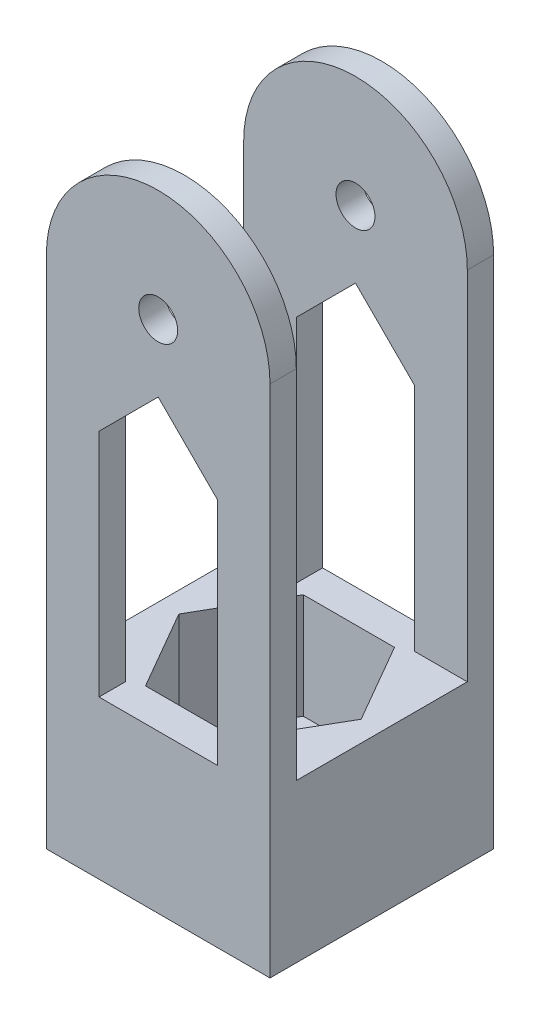
ISO-10303-21;
HEADER;
FILE_DESCRIPTION(('STEP AP214'),'2;1');
FILE_NAME('part.step','',(''),(''),'','','');
FILE_SCHEMA(('AUTOMOTIVE_DESIGN { 1 0 10303 214 1 1 1 1 }'));
ENDSEC;
DATA;
#1=APPLICATION_CONTEXT('core data for automotive mechanical design processes');
#2=APPLICATION_PROTOCOL_DEFINITION('international standard','automotive_design',2000,#1);
#3=PRODUCT_CONTEXT('',#1,'mechanical');
#4=PRODUCT('Part','Part','',(#3));
#5=PRODUCT_RELATED_PRODUCT_CATEGORY('part','',(#4));
#6=PRODUCT_DEFINITION_FORMATION('','',#4);
#7=PRODUCT_DEFINITION_CONTEXT('part definition',#1,'design');
#8=PRODUCT_DEFINITION('design','',#6,#7);
#9=PRODUCT_DEFINITION_SHAPE('','',#8);
#10=(LENGTH_UNIT() NAMED_UNIT(*) SI_UNIT(.MILLI.,.METRE.));
#11=(NAMED_UNIT(*) PLANE_ANGLE_UNIT() SI_UNIT($,.RADIAN.));
#12=(NAMED_UNIT(*) SI_UNIT($,.STERADIAN.) SOLID_ANGLE_UNIT());
#13=UNCERTAINTY_MEASURE_WITH_UNIT(LENGTH_MEASURE(1.E-05),#10,'distance_accuracy_value','');
#14=(GEOMETRIC_REPRESENTATION_CONTEXT(3) GLOBAL_UNCERTAINTY_ASSIGNED_CONTEXT((#13)) GLOBAL_UNIT_ASSIGNED_CONTEXT((#10,
#11,#12)) REPRESENTATION_CONTEXT('',''));
#15=CARTESIAN_POINT('',(0.,0.,0.));
#16=DIRECTION('',(0.,0.,1.));
#17=DIRECTION('',(1.,0.,0.));
#18=AXIS2_PLACEMENT_3D('',#15,#16,#17);
#19=CARTESIAN_POINT('',(0.,19.05,0.));
#20=DIRECTION('',(0.,1.,0.));
#21=DIRECTION('',(0.,0.,1.));
#22=AXIS2_PLACEMENT_3D('',#19,#20,#21);
#23=PLANE('',#22);
#24=DIRECTION('',(-0.5,0.,-0.866025403784439));
#25=VECTOR('',#24,1.);
#26=CARTESIAN_POINT('',(24.4922726280624,19.05,-13.49375));
#27=LINE('',#26,#25);
#28=CARTESIAN_POINT('',(24.4922726280624,19.05,-13.49375));
#29=VERTEX_POINT('',#28);
#30=CARTESIAN_POINT('',(18.9930113140312,19.05,-23.01875));
#31=VERTEX_POINT('',#30);
#32=EDGE_CURVE('E439',#29,#31,#27,.T.);
#33=ORIENTED_EDGE('',*,*,#32,.F.);
#34=DIRECTION('',(0.5,0.,-0.866025403784439));
#35=VECTOR('',#34,1.);
#36=CARTESIAN_POINT('',(18.9930113140312,19.05,-3.96874999999999));
#37=LINE('',#36,#35);
#38=CARTESIAN_POINT('',(18.9930113140312,19.05,-3.96874999999999));
#39=VERTEX_POINT('',#38);
#40=EDGE_CURVE('E461',#39,#29,#37,.T.);
#41=ORIENTED_EDGE('',*,*,#40,.F.);
#42=DIRECTION('',(1.,0.,0.));
#43=VECTOR('',#42,1.);
#44=CARTESIAN_POINT('',(7.99448868596881,19.05,-3.96875));
#45=LINE('',#44,#43);
#46=CARTESIAN_POINT('',(7.99448868596881,19.05,-3.96875));
#47=VERTEX_POINT('',#46);
#48=EDGE_CURVE('E458',#47,#39,#45,.T.);
#49=ORIENTED_EDGE('',*,*,#48,.F.);
#50=DIRECTION('',(0.5,0.,0.866025403784439));
#51=VECTOR('',#50,1.);
#52=CARTESIAN_POINT('',(2.49522737193762,19.05,-13.49375));
#53=LINE('',#52,#51);
#54=CARTESIAN_POINT('',(2.49522737193762,19.05,-13.49375));
#55=VERTEX_POINT('',#54);
#56=EDGE_CURVE('E456',#55,#47,#53,.T.);
#57=ORIENTED_EDGE('',*,*,#56,.F.);
#58=DIRECTION('',(-0.5,0.,0.866025403784439));
#59=VECTOR('',#58,1.);
#60=CARTESIAN_POINT('',(7.9944886859688,19.05,-23.01875));
#61=LINE('',#60,#59);
#62=CARTESIAN_POINT('',(7.99448868596881,19.05,-23.01875));
#63=VERTEX_POINT('',#62);
#64=EDGE_CURVE('E431',#63,#55,#61,.T.);
#65=ORIENTED_EDGE('',*,*,#64,.F.);
#66=DIRECTION('',(-1.,0.,0.));
#67=VECTOR('',#66,1.);
#68=CARTESIAN_POINT('',(18.9930113140312,19.05,-23.01875));
#69=LINE('',#68,#67);
#70=EDGE_CURVE('E430',#31,#63,#69,.T.);
#71=ORIENTED_EDGE('',*,*,#70,.F.);
#72=EDGE_LOOP('',(#33,#41,#49,#57,#65,#71));
#73=FACE_BOUND('',#72,.T.);
#74=DIRECTION('',(0.,0.,-1.));
#75=VECTOR('',#74,1.);
#76=CARTESIAN_POINT('',(20.6375,19.05,0.));
#77=LINE('',#76,#75);
#78=CARTESIAN_POINT('',(20.6375,19.05,0.));
#79=VERTEX_POINT('',#78);
#80=CARTESIAN_POINT('',(20.6375,19.05,-3.175));
#81=VERTEX_POINT('',#80);
#82=EDGE_CURVE('E200',#79,#81,#77,.T.);
#83=ORIENTED_EDGE('',*,*,#82,.T.);
#84=DIRECTION('',(-1.,0.,0.));
#85=VECTOR('',#84,1.);
#86=CARTESIAN_POINT('',(0.,19.05,-3.175));
#87=LINE('',#86,#85);
#88=CARTESIAN_POINT('',(26.9875,19.05,-3.175));
#89=VERTEX_POINT('',#88);
#90=EDGE_CURVE('E277',#89,#81,#87,.T.);
#91=ORIENTED_EDGE('',*,*,#90,.F.);
#92=DIRECTION('',(0.,0.,-1.));
#93=VECTOR('',#92,1.);
#94=CARTESIAN_POINT('',(26.9875,19.05,0.));
#95=LINE('',#94,#93);
#96=CARTESIAN_POINT('',(26.9875,19.05,-23.8125));
#97=VERTEX_POINT('',#96);
#98=EDGE_CURVE('E327',#89,#97,#95,.T.);
#99=ORIENTED_EDGE('',*,*,#98,.T.);
#100=DIRECTION('',(-1.,0.,0.));
#101=VECTOR('',#100,1.);
#102=CARTESIAN_POINT('',(0.,19.05,-23.8125));
#103=LINE('',#102,#101);
#104=CARTESIAN_POINT('',(20.6375,19.05,-23.8125));
#105=VERTEX_POINT('',#104);
#106=EDGE_CURVE('E307',#97,#105,#103,.T.);
#107=ORIENTED_EDGE('',*,*,#106,.T.);
#108=CARTESIAN_POINT('',(20.6375,19.05,-26.9875));
#109=VERTEX_POINT('',#108);
#110=EDGE_CURVE('E211',#105,#109,#77,.T.);
#111=ORIENTED_EDGE('',*,*,#110,.T.);
#112=DIRECTION('',(-1.,0.,0.));
#113=VECTOR('',#112,1.);
#114=CARTESIAN_POINT('',(20.6375,19.05,-26.9875));
#115=LINE('',#114,#113);
#116=CARTESIAN_POINT('',(6.34999999999999,19.05,-26.9875));
#117=VERTEX_POINT('',#116);
#118=EDGE_CURVE('E234',#109,#117,#115,.T.);
#119=ORIENTED_EDGE('',*,*,#118,.T.);
#120=DIRECTION('',(0.,0.,-1.));
#121=VECTOR('',#120,1.);
#122=CARTESIAN_POINT('',(6.34999999999999,19.05,0.));
#123=LINE('',#122,#121);
#124=CARTESIAN_POINT('',(6.34999999999999,19.05,-23.8125));
#125=VERTEX_POINT('',#124);
#126=EDGE_CURVE('E210',#125,#117,#123,.T.);
#127=ORIENTED_EDGE('',*,*,#126,.F.);
#128=CARTESIAN_POINT('',(0.,19.05,-23.8125));
#129=VERTEX_POINT('',#128);
#130=EDGE_CURVE('E41',#125,#129,#103,.T.);
#131=ORIENTED_EDGE('',*,*,#130,.T.);
#132=DIRECTION('',(0.,0.,-1.));
#133=VECTOR('',#132,1.);
#134=CARTESIAN_POINT('',(0.,19.05,0.));
#135=LINE('',#134,#133);
#136=CARTESIAN_POINT('',(0.,19.05,-3.175));
#137=VERTEX_POINT('',#136);
#138=EDGE_CURVE('E322',#137,#129,#135,.T.);
#139=ORIENTED_EDGE('',*,*,#138,.F.);
#140=CARTESIAN_POINT('',(6.34999999999999,19.05,-3.175));
#141=VERTEX_POINT('',#140);
#142=EDGE_CURVE('E276',#141,#137,#87,.T.);
#143=ORIENTED_EDGE('',*,*,#142,.F.);
#144=CARTESIAN_POINT('',(6.34999999999999,19.05,0.));
#145=VERTEX_POINT('',#144);
#146=EDGE_CURVE('E216',#145,#141,#123,.T.);
#147=ORIENTED_EDGE('',*,*,#146,.F.);
#148=DIRECTION('',(-1.,0.,0.));
#149=VECTOR('',#148,1.);
#150=CARTESIAN_POINT('',(20.6375,19.05,0.));
#151=LINE('',#150,#149);
#152=EDGE_CURVE('E214',#79,#145,#151,.T.);
#153=ORIENTED_EDGE('',*,*,#152,.F.);
#154=EDGE_LOOP('',(#83,#91,#99,#107,#111,#119,#127,#131,#139,#143,#147,#153));
#155=FACE_BOUND('',#154,.T.);
#156=ADVANCED_FACE('F37',(#73,#155),#23,.T.);
#157=CARTESIAN_POINT('',(13.49375,0.,-13.49375));
#158=DIRECTION('',(0.,1.,0.));
#159=DIRECTION('',(0.,0.,1.));
#160=AXIS2_PLACEMENT_3D('',#157,#158,#159);
#161=CYLINDRICAL_SURFACE('',#160,6.985);
#162=CARTESIAN_POINT('',(13.49375,0.,-13.49375));
#163=DIRECTION('',(0.,1.,0.));
#164=DIRECTION('',(0.,0.,1.));
#165=AXIS2_PLACEMENT_3D('',#162,#163,#164);
#166=CIRCLE('',#165,6.985);
#167=CARTESIAN_POINT('',(13.49375,0.,-6.50875));
#168=VERTEX_POINT('',#167);
#169=EDGE_CURVE('E338',#168,#168,#166,.T.);
#170=ORIENTED_EDGE('',*,*,#169,.F.);
#171=EDGE_LOOP('',(#170));
#172=FACE_BOUND('',#171,.T.);
#173=CARTESIAN_POINT('',(13.49375,6.35,-13.49375));
#174=DIRECTION('',(0.,1.,0.));
#175=DIRECTION('',(0.,0.,1.));
#176=AXIS2_PLACEMENT_3D('',#173,#174,#175);
#177=CIRCLE('',#176,6.985);
#178=CARTESIAN_POINT('',(13.49375,6.35,-6.50875));
#179=VERTEX_POINT('',#178);
#180=EDGE_CURVE('E312',#179,#179,#177,.F.);
#181=ORIENTED_EDGE('',*,*,#180,.F.);
#182=EDGE_LOOP('',(#181));
#183=FACE_BOUND('',#182,.T.);
#184=ADVANCED_FACE('F387',(#172,#183),#161,.F.);
#185=CARTESIAN_POINT('',(0.,19.05,0.));
#186=DIRECTION('',(0.,0.,-1.));
#187=DIRECTION('',(-1.,0.,0.));
#188=AXIS2_PLACEMENT_3D('',#185,#186,#187);
#189=PLANE('',#188);
#190=DIRECTION('',(0.707106781186549,-0.707106781186546,0.));
#191=VECTOR('',#190,1.);
#192=CARTESIAN_POINT('',(20.6375,46.83125,0.));
#193=LINE('',#192,#191);
#194=CARTESIAN_POINT('',(13.49375,53.975,0.));
#195=VERTEX_POINT('',#194);
#196=CARTESIAN_POINT('',(20.6375,46.83125,0.));
#197=VERTEX_POINT('',#196);
#198=EDGE_CURVE('E222',#195,#197,#193,.T.);
#199=ORIENTED_EDGE('',*,*,#198,.T.);
#200=DIRECTION('',(0.,-1.,0.));
#201=VECTOR('',#200,1.);
#202=CARTESIAN_POINT('',(20.6375,19.05,0.));
#203=LINE('',#202,#201);
#204=EDGE_CURVE('E205',#197,#79,#203,.T.);
#205=ORIENTED_EDGE('',*,*,#204,.T.);
#206=ORIENTED_EDGE('',*,*,#152,.T.);
#207=DIRECTION('',(0.,1.,0.));
#208=VECTOR('',#207,1.);
#209=CARTESIAN_POINT('',(6.34999999999999,19.05,0.));
#210=LINE('',#209,#208);
#211=CARTESIAN_POINT('',(6.34999999999999,46.83125,0.));
#212=VERTEX_POINT('',#211);
#213=EDGE_CURVE('E54',#145,#212,#210,.T.);
#214=ORIENTED_EDGE('',*,*,#213,.T.);
#215=DIRECTION('',(0.707106781186546,0.707106781186549,0.));
#216=VECTOR('',#215,1.);
#217=CARTESIAN_POINT('',(13.49375,53.975,0.));
#218=LINE('',#217,#216);
#219=EDGE_CURVE('E230',#212,#195,#218,.T.);
#220=ORIENTED_EDGE('',*,*,#219,.T.);
#221=EDGE_LOOP('',(#199,#205,#206,#214,#220));
#222=FACE_BOUND('',#221,.T.);
#223=DIRECTION('',(1.,0.,0.));
#224=VECTOR('',#223,1.);
#225=CARTESIAN_POINT('',(0.,0.,0.));
#226=LINE('',#225,#224);
#227=CARTESIAN_POINT('',(0.,0.,0.));
#228=VERTEX_POINT('',#227);
#229=CARTESIAN_POINT('',(26.9875,0.,0.));
#230=VERTEX_POINT('',#229);
#231=EDGE_CURVE('E334',#228,#230,#226,.T.);
#232=ORIENTED_EDGE('',*,*,#231,.T.);
#233=DIRECTION('',(0.,-1.,0.));
#234=VECTOR('',#233,1.);
#235=CARTESIAN_POINT('',(26.9875,19.05,0.));
#236=LINE('',#235,#234);
#237=CARTESIAN_POINT('',(26.9875,62.0875,0.));
#238=VERTEX_POINT('',#237);
#239=EDGE_CURVE('E351',#238,#230,#236,.T.);
#240=ORIENTED_EDGE('',*,*,#239,.F.);
#241=CARTESIAN_POINT('',(13.49375,62.0875,0.));
#242=DIRECTION('',(0.,0.,-1.));
#243=DIRECTION('',(-1.,0.,0.));
#244=AXIS2_PLACEMENT_3D('',#241,#242,#243);
#245=CIRCLE('',#244,13.49375);
#246=CARTESIAN_POINT('',(0.,62.0875,0.));
#247=VERTEX_POINT('',#246);
#248=EDGE_CURVE('E270',#247,#238,#245,.T.);
#249=ORIENTED_EDGE('',*,*,#248,.F.);
#250=DIRECTION('',(0.,-1.,0.));
#251=VECTOR('',#250,1.);
#252=CARTESIAN_POINT('',(0.,19.05,0.));
#253=LINE('',#252,#251);
#254=EDGE_CURVE('E326',#247,#228,#253,.T.);
#255=ORIENTED_EDGE('',*,*,#254,.T.);
#256=EDGE_LOOP('',(#232,#240,#249,#255));
#257=FACE_BOUND('',#256,.T.);
#258=CARTESIAN_POINT('',(13.49375,62.0875,0.));
#259=DIRECTION('',(0.,0.,-1.));
#260=DIRECTION('',(-1.,0.,0.));
#261=AXIS2_PLACEMENT_3D('',#258,#259,#260);
#262=CIRCLE('',#261,2.3495);
#263=CARTESIAN_POINT('',(11.14425,62.0875,0.));
#264=VERTEX_POINT('',#263);
#265=EDGE_CURVE('E266',#264,#264,#262,.T.);
#266=ORIENTED_EDGE('',*,*,#265,.T.);
#267=EDGE_LOOP('',(#266));
#268=FACE_BOUND('',#267,.T.);
#269=ADVANCED_FACE('F39',(#222,#257,#268),#189,.F.);
#270=CARTESIAN_POINT('',(26.9875,19.05,0.));
#271=DIRECTION('',(-1.,0.,0.));
#272=DIRECTION('',(0.,0.,1.));
#273=AXIS2_PLACEMENT_3D('',#270,#271,#272);
#274=PLANE('',#273);
#275=DIRECTION('',(0.,0.,-1.));
#276=VECTOR('',#275,1.);
#277=CARTESIAN_POINT('',(26.9875,0.,0.));
#278=LINE('',#277,#276);
#279=CARTESIAN_POINT('',(26.9875,0.,-26.9875));
#280=VERTEX_POINT('',#279);
#281=EDGE_CURVE('E337',#230,#280,#278,.T.);
#282=ORIENTED_EDGE('',*,*,#281,.T.);
#283=DIRECTION('',(0.,-1.,0.));
#284=VECTOR('',#283,1.);
#285=CARTESIAN_POINT('',(26.9875,19.05,-26.9875));
#286=LINE('',#285,#284);
#287=CARTESIAN_POINT('',(26.9875,62.0875,-26.9875));
#288=VERTEX_POINT('',#287);
#289=EDGE_CURVE('E350',#288,#280,#286,.T.);
#290=ORIENTED_EDGE('',*,*,#289,.F.);
#291=DIRECTION('',(0.,0.,-1.));
#292=VECTOR('',#291,1.);
#293=CARTESIAN_POINT('',(26.9875,62.0875,-23.8125));
#294=LINE('',#293,#292);
#295=CARTESIAN_POINT('',(26.9875,62.0875,-23.8125));
#296=VERTEX_POINT('',#295);
#297=EDGE_CURVE('E428',#296,#288,#294,.T.);
#298=ORIENTED_EDGE('',*,*,#297,.F.);
#299=DIRECTION('',(0.,-1.,0.));
#300=VECTOR('',#299,1.);
#301=CARTESIAN_POINT('',(26.9875,19.05,-23.8125));
#302=LINE('',#301,#300);
#303=EDGE_CURVE('E300',#296,#97,#302,.T.);
#304=ORIENTED_EDGE('',*,*,#303,.T.);
#305=ORIENTED_EDGE('',*,*,#98,.F.);
#306=DIRECTION('',(0.,-1.,0.));
#307=VECTOR('',#306,1.);
#308=CARTESIAN_POINT('',(26.9875,19.05,-3.175));
#309=LINE('',#308,#307);
#310=CARTESIAN_POINT('',(26.9875,62.0875,-3.175));
#311=VERTEX_POINT('',#310);
#312=EDGE_CURVE('E279',#311,#89,#309,.T.);
#313=ORIENTED_EDGE('',*,*,#312,.F.);
#314=DIRECTION('',(0.,0.,1.));
#315=VECTOR('',#314,1.);
#316=CARTESIAN_POINT('',(26.9875,62.0875,-3.175));
#317=LINE('',#316,#315);
#318=EDGE_CURVE('E283',#311,#238,#317,.T.);
#319=ORIENTED_EDGE('',*,*,#318,.T.);
#320=ORIENTED_EDGE('',*,*,#239,.T.);
#321=EDGE_LOOP('',(#282,#290,#298,#304,#305,#313,#319,#320));
#322=FACE_BOUND('',#321,.T.);
#323=ADVANCED_FACE('F409',(#322),#274,.F.);
#324=CARTESIAN_POINT('',(0.,19.05,-26.9875));
#325=DIRECTION('',(0.,0.,-1.));
#326=DIRECTION('',(-1.,0.,0.));
#327=AXIS2_PLACEMENT_3D('',#324,#325,#326);
#328=PLANE('',#327);
#329=DIRECTION('',(0.,-1.,0.));
#330=VECTOR('',#329,1.);
#331=CARTESIAN_POINT('',(20.6375,19.05,-26.9875));
#332=LINE('',#331,#330);
#333=CARTESIAN_POINT('',(20.6375,46.83125,-26.9875));
#334=VERTEX_POINT('',#333);
#335=EDGE_CURVE('E62',#334,#109,#332,.T.);
#336=ORIENTED_EDGE('',*,*,#335,.F.);
#337=DIRECTION('',(0.707106781186549,-0.707106781186546,0.));
#338=VECTOR('',#337,1.);
#339=CARTESIAN_POINT('',(20.6375,46.83125,-26.9875));
#340=LINE('',#339,#338);
#341=CARTESIAN_POINT('',(13.49375,53.975,-26.9875));
#342=VERTEX_POINT('',#341);
#343=EDGE_CURVE('E223',#342,#334,#340,.T.);
#344=ORIENTED_EDGE('',*,*,#343,.F.);
#345=DIRECTION('',(0.707106781186546,0.707106781186549,0.));
#346=VECTOR('',#345,1.);
#347=CARTESIAN_POINT('',(13.49375,53.975,-26.9875));
#348=LINE('',#347,#346);
#349=CARTESIAN_POINT('',(6.34999999999999,46.83125,-26.9875));
#350=VERTEX_POINT('',#349);
#351=EDGE_CURVE('E226',#350,#342,#348,.T.);
#352=ORIENTED_EDGE('',*,*,#351,.F.);
#353=DIRECTION('',(0.,1.,0.));
#354=VECTOR('',#353,1.);
#355=CARTESIAN_POINT('',(6.34999999999999,19.05,-26.9875));
#356=LINE('',#355,#354);
#357=EDGE_CURVE('E237',#117,#350,#356,.T.);
#358=ORIENTED_EDGE('',*,*,#357,.F.);
#359=ORIENTED_EDGE('',*,*,#118,.F.);
#360=EDGE_LOOP('',(#336,#344,#352,#358,#359));
#361=FACE_BOUND('',#360,.T.);
#362=DIRECTION('',(1.,0.,0.));
#363=VECTOR('',#362,1.);
#364=CARTESIAN_POINT('',(0.,0.,-26.9875));
#365=LINE('',#364,#363);
#366=CARTESIAN_POINT('',(0.,0.,-26.9875));
#367=VERTEX_POINT('',#366);
#368=EDGE_CURVE('E341',#367,#280,#365,.T.);
#369=ORIENTED_EDGE('',*,*,#368,.F.);
#370=DIRECTION('',(0.,-1.,0.));
#371=VECTOR('',#370,1.);
#372=CARTESIAN_POINT('',(0.,19.05,-26.9875));
#373=LINE('',#372,#371);
#374=CARTESIAN_POINT('',(0.,62.0875,-26.9875));
#375=VERTEX_POINT('',#374);
#376=EDGE_CURVE('E348',#375,#367,#373,.T.);
#377=ORIENTED_EDGE('',*,*,#376,.F.);
#378=CARTESIAN_POINT('',(13.49375,62.0875,-26.9875));
#379=DIRECTION('',(0.,0.,-1.));
#380=DIRECTION('',(-1.,0.,0.));
#381=AXIS2_PLACEMENT_3D('',#378,#379,#380);
#382=CIRCLE('',#381,13.49375);
#383=EDGE_CURVE('E295',#375,#288,#382,.T.);
#384=ORIENTED_EDGE('',*,*,#383,.T.);
#385=ORIENTED_EDGE('',*,*,#289,.T.);
#386=EDGE_LOOP('',(#369,#377,#384,#385));
#387=FACE_BOUND('',#386,.T.);
#388=CARTESIAN_POINT('',(13.49375,62.0875,-26.9875));
#389=DIRECTION('',(0.,0.,-1.));
#390=DIRECTION('',(-1.,0.,0.));
#391=AXIS2_PLACEMENT_3D('',#388,#389,#390);
#392=CIRCLE('',#391,2.3495);
#393=CARTESIAN_POINT('',(11.14425,62.0875,-26.9875));
#394=VERTEX_POINT('',#393);
#395=EDGE_CURVE('E289',#394,#394,#392,.T.);
#396=ORIENTED_EDGE('',*,*,#395,.F.);
#397=EDGE_LOOP('',(#396));
#398=FACE_BOUND('',#397,.T.);
#399=ADVANCED_FACE('F406',(#361,#387,#398),#328,.T.);
#400=CARTESIAN_POINT('',(0.,19.05,0.));
#401=DIRECTION('',(-1.,0.,0.));
#402=DIRECTION('',(0.,0.,1.));
#403=AXIS2_PLACEMENT_3D('',#400,#401,#402);
#404=PLANE('',#403);
#405=DIRECTION('',(0.,0.,-1.));
#406=VECTOR('',#405,1.);
#407=CARTESIAN_POINT('',(0.,0.,0.));
#408=LINE('',#407,#406);
#409=EDGE_CURVE('E344',#228,#367,#408,.T.);
#410=ORIENTED_EDGE('',*,*,#409,.F.);
#411=ORIENTED_EDGE('',*,*,#254,.F.);
#412=DIRECTION('',(0.,0.,1.));
#413=VECTOR('',#412,1.);
#414=CARTESIAN_POINT('',(0.,62.0875,-3.175));
#415=LINE('',#414,#413);
#416=CARTESIAN_POINT('',(0.,62.0875,-3.175));
#417=VERTEX_POINT('',#416);
#418=EDGE_CURVE('E286',#417,#247,#415,.T.);
#419=ORIENTED_EDGE('',*,*,#418,.F.);
#420=DIRECTION('',(0.,1.,0.));
#421=VECTOR('',#420,1.);
#422=CARTESIAN_POINT('',(0.,62.0875,-3.175));
#423=LINE('',#422,#421);
#424=EDGE_CURVE('E273',#137,#417,#423,.T.);
#425=ORIENTED_EDGE('',*,*,#424,.F.);
#426=ORIENTED_EDGE('',*,*,#138,.T.);
#427=DIRECTION('',(0.,1.,0.));
#428=VECTOR('',#427,1.);
#429=CARTESIAN_POINT('',(0.,62.0875,-23.8125));
#430=LINE('',#429,#428);
#431=CARTESIAN_POINT('',(0.,62.0875,-23.8125));
#432=VERTEX_POINT('',#431);
#433=EDGE_CURVE('E301',#129,#432,#430,.T.);
#434=ORIENTED_EDGE('',*,*,#433,.T.);
#435=DIRECTION('',(0.,0.,-1.));
#436=VECTOR('',#435,1.);
#437=CARTESIAN_POINT('',(0.,62.0875,-23.8125));
#438=LINE('',#437,#436);
#439=EDGE_CURVE('E311',#432,#375,#438,.T.);
#440=ORIENTED_EDGE('',*,*,#439,.T.);
#441=ORIENTED_EDGE('',*,*,#376,.T.);
#442=EDGE_LOOP('',(#410,#411,#419,#425,#426,#434,#440,#441));
#443=FACE_BOUND('',#442,.T.);
#444=ADVANCED_FACE('F402',(#443),#404,.T.);
#445=CARTESIAN_POINT('',(0.,0.,0.));
#446=DIRECTION('',(0.,1.,0.));
#447=DIRECTION('',(0.,0.,1.));
#448=AXIS2_PLACEMENT_3D('',#445,#446,#447);
#449=PLANE('',#448);
#450=ORIENTED_EDGE('',*,*,#169,.T.);
#451=EDGE_LOOP('',(#450));
#452=FACE_BOUND('',#451,.T.);
#453=ORIENTED_EDGE('',*,*,#231,.F.);
#454=ORIENTED_EDGE('',*,*,#409,.T.);
#455=ORIENTED_EDGE('',*,*,#368,.T.);
#456=ORIENTED_EDGE('',*,*,#281,.F.);
#457=EDGE_LOOP('',(#453,#454,#455,#456));
#458=FACE_BOUND('',#457,.T.);
#459=ADVANCED_FACE('F398',(#452,#458),#449,.F.);
#460=CARTESIAN_POINT('',(0.,6.35,0.));
#461=DIRECTION('',(0.,1.,0.));
#462=DIRECTION('',(0.,0.,1.));
#463=AXIS2_PLACEMENT_3D('',#460,#461,#462);
#464=PLANE('',#463);
#465=DIRECTION('',(-1.,0.,0.));
#466=VECTOR('',#465,1.);
#467=CARTESIAN_POINT('',(18.9930113140312,6.35,-23.01875));
#468=LINE('',#467,#466);
#469=CARTESIAN_POINT('',(18.9930113140312,6.35,-23.01875));
#470=VERTEX_POINT('',#469);
#471=CARTESIAN_POINT('',(7.9944886859688,6.35,-23.01875));
#472=VERTEX_POINT('',#471);
#473=EDGE_CURVE('E435',#470,#472,#468,.T.);
#474=ORIENTED_EDGE('',*,*,#473,.T.);
#475=DIRECTION('',(-0.5,0.,0.866025403784439));
#476=VECTOR('',#475,1.);
#477=CARTESIAN_POINT('',(7.9944886859688,6.35,-23.01875));
#478=LINE('',#477,#476);
#479=CARTESIAN_POINT('',(2.49522737193762,6.35,-13.49375));
#480=VERTEX_POINT('',#479);
#481=EDGE_CURVE('E438',#472,#480,#478,.T.);
#482=ORIENTED_EDGE('',*,*,#481,.T.);
#483=DIRECTION('',(0.5,0.,0.866025403784439));
#484=VECTOR('',#483,1.);
#485=CARTESIAN_POINT('',(2.49522737193762,6.35,-13.49375));
#486=LINE('',#485,#484);
#487=CARTESIAN_POINT('',(7.99448868596881,6.35,-3.96875));
#488=VERTEX_POINT('',#487);
#489=EDGE_CURVE('E442',#480,#488,#486,.T.);
#490=ORIENTED_EDGE('',*,*,#489,.T.);
#491=DIRECTION('',(1.,0.,0.));
#492=VECTOR('',#491,1.);
#493=CARTESIAN_POINT('',(7.99448868596881,6.35,-3.96875));
#494=LINE('',#493,#492);
#495=CARTESIAN_POINT('',(18.9930113140312,6.35,-3.96874999999999));
#496=VERTEX_POINT('',#495);
#497=EDGE_CURVE('E445',#488,#496,#494,.T.);
#498=ORIENTED_EDGE('',*,*,#497,.T.);
#499=DIRECTION('',(0.5,0.,-0.866025403784439));
#500=VECTOR('',#499,1.);
#501=CARTESIAN_POINT('',(18.9930113140312,6.35,-3.96874999999999));
#502=LINE('',#501,#500);
#503=CARTESIAN_POINT('',(24.4922726280624,6.35,-13.49375));
#504=VERTEX_POINT('',#503);
#505=EDGE_CURVE('E448',#496,#504,#502,.T.);
#506=ORIENTED_EDGE('',*,*,#505,.T.);
#507=DIRECTION('',(-0.5,0.,-0.866025403784439));
#508=VECTOR('',#507,1.);
#509=CARTESIAN_POINT('',(24.4922726280624,6.35,-13.49375));
#510=LINE('',#509,#508);
#511=EDGE_CURVE('E451',#504,#470,#510,.T.);
#512=ORIENTED_EDGE('',*,*,#511,.T.);
#513=EDGE_LOOP('',(#474,#482,#490,#498,#506,#512));
#514=FACE_BOUND('',#513,.T.);
#515=ORIENTED_EDGE('',*,*,#180,.T.);
#516=EDGE_LOOP('',(#515));
#517=FACE_BOUND('',#516,.T.);
#518=ADVANCED_FACE('F401',(#514,#517),#464,.T.);
#519=CARTESIAN_POINT('',(18.9930113140312,6.35,-23.01875));
#520=DIRECTION('',(0.,0.,-1.));
#521=DIRECTION('',(-1.,0.,0.));
#522=AXIS2_PLACEMENT_3D('',#519,#520,#521);
#523=PLANE('',#522);
#524=ORIENTED_EDGE('',*,*,#70,.T.);
#525=DIRECTION('',(0.,1.,0.));
#526=VECTOR('',#525,1.);
#527=CARTESIAN_POINT('',(7.9944886859688,6.35,-23.01875));
#528=LINE('',#527,#526);
#529=EDGE_CURVE('E453',#472,#63,#528,.T.);
#530=ORIENTED_EDGE('',*,*,#529,.F.);
#531=ORIENTED_EDGE('',*,*,#473,.F.);
#532=DIRECTION('',(0.,1.,0.));
#533=VECTOR('',#532,1.);
#534=CARTESIAN_POINT('',(18.9930113140312,6.35,-23.01875));
#535=LINE('',#534,#533);
#536=EDGE_CURVE('E464',#470,#31,#535,.T.);
#537=ORIENTED_EDGE('',*,*,#536,.T.);
#538=EDGE_LOOP('',(#524,#530,#531,#537));
#539=FACE_BOUND('',#538,.T.);
#540=ADVANCED_FACE('F486',(#539),#523,.F.);
#541=CARTESIAN_POINT('',(24.4922726280624,6.35,-13.49375));
#542=DIRECTION('',(0.866025403784439,0.,-0.5));
#543=DIRECTION('',(-0.5,0.,-0.866025403784439));
#544=AXIS2_PLACEMENT_3D('',#541,#542,#543);
#545=PLANE('',#544);
#546=ORIENTED_EDGE('',*,*,#32,.T.);
#547=ORIENTED_EDGE('',*,*,#536,.F.);
#548=ORIENTED_EDGE('',*,*,#511,.F.);
#549=DIRECTION('',(0.,1.,0.));
#550=VECTOR('',#549,1.);
#551=CARTESIAN_POINT('',(24.4922726280624,6.35,-13.49375));
#552=LINE('',#551,#550);
#553=EDGE_CURVE('E467',#504,#29,#552,.T.);
#554=ORIENTED_EDGE('',*,*,#553,.T.);
#555=EDGE_LOOP('',(#546,#547,#548,#554));
#556=FACE_BOUND('',#555,.T.);
#557=ADVANCED_FACE('F492',(#556),#545,.F.);
#558=CARTESIAN_POINT('',(18.9930113140312,6.35,-3.96874999999999));
#559=DIRECTION('',(0.866025403784438,0.,0.5));
#560=DIRECTION('',(0.5,0.,-0.866025403784439));
#561=AXIS2_PLACEMENT_3D('',#558,#559,#560);
#562=PLANE('',#561);
#563=ORIENTED_EDGE('',*,*,#40,.T.);
#564=ORIENTED_EDGE('',*,*,#553,.F.);
#565=ORIENTED_EDGE('',*,*,#505,.F.);
#566=DIRECTION('',(0.,1.,0.));
#567=VECTOR('',#566,1.);
#568=CARTESIAN_POINT('',(18.9930113140312,6.35,-3.96874999999999));
#569=LINE('',#568,#567);
#570=EDGE_CURVE('E470',#496,#39,#569,.T.);
#571=ORIENTED_EDGE('',*,*,#570,.T.);
#572=EDGE_LOOP('',(#563,#564,#565,#571));
#573=FACE_BOUND('',#572,.T.);
#574=ADVANCED_FACE('F499',(#573),#562,.F.);
#575=CARTESIAN_POINT('',(7.99448868596881,6.35,-3.96875));
#576=DIRECTION('',(0.,0.,1.));
#577=DIRECTION('',(1.,0.,0.));
#578=AXIS2_PLACEMENT_3D('',#575,#576,#577);
#579=PLANE('',#578);
#580=ORIENTED_EDGE('',*,*,#48,.T.);
#581=ORIENTED_EDGE('',*,*,#570,.F.);
#582=ORIENTED_EDGE('',*,*,#497,.F.);
#583=DIRECTION('',(0.,1.,0.));
#584=VECTOR('',#583,1.);
#585=CARTESIAN_POINT('',(7.99448868596881,6.35,-3.96875));
#586=LINE('',#585,#584);
#587=EDGE_CURVE('E472',#488,#47,#586,.T.);
#588=ORIENTED_EDGE('',*,*,#587,.T.);
#589=EDGE_LOOP('',(#580,#581,#582,#588));
#590=FACE_BOUND('',#589,.T.);
#591=ADVANCED_FACE('F503',(#590),#579,.F.);
#592=CARTESIAN_POINT('',(2.49522737193762,6.35,-13.49375));
#593=DIRECTION('',(-0.866025403784439,0.,0.5));
#594=DIRECTION('',(0.5,0.,0.866025403784439));
#595=AXIS2_PLACEMENT_3D('',#592,#593,#594);
#596=PLANE('',#595);
#597=ORIENTED_EDGE('',*,*,#56,.T.);
#598=ORIENTED_EDGE('',*,*,#587,.F.);
#599=ORIENTED_EDGE('',*,*,#489,.F.);
#600=DIRECTION('',(0.,1.,0.));
#601=VECTOR('',#600,1.);
#602=CARTESIAN_POINT('',(2.49522737193762,6.35,-13.49375));
#603=LINE('',#602,#601);
#604=EDGE_CURVE('E475',#480,#55,#603,.T.);
#605=ORIENTED_EDGE('',*,*,#604,.T.);
#606=EDGE_LOOP('',(#597,#598,#599,#605));
#607=FACE_BOUND('',#606,.T.);
#608=ADVANCED_FACE('F507',(#607),#596,.F.);
#609=CARTESIAN_POINT('',(7.9944886859688,6.35,-23.01875));
#610=DIRECTION('',(-0.866025403784438,0.,-0.5));
#611=DIRECTION('',(-0.5,0.,0.866025403784439));
#612=AXIS2_PLACEMENT_3D('',#609,#610,#611);
#613=PLANE('',#612);
#614=ORIENTED_EDGE('',*,*,#64,.T.);
#615=ORIENTED_EDGE('',*,*,#604,.F.);
#616=ORIENTED_EDGE('',*,*,#481,.F.);
#617=ORIENTED_EDGE('',*,*,#529,.T.);
#618=EDGE_LOOP('',(#614,#615,#616,#617));
#619=FACE_BOUND('',#618,.T.);
#620=ADVANCED_FACE('F511',(#619),#613,.F.);
#621=CARTESIAN_POINT('',(13.49375,62.0875,-23.8125));
#622=DIRECTION('',(0.,0.,-1.));
#623=DIRECTION('',(-1.,0.,0.));
#624=AXIS2_PLACEMENT_3D('',#621,#622,#623);
#625=CYLINDRICAL_SURFACE('',#624,13.49375);
#626=ORIENTED_EDGE('',*,*,#383,.F.);
#627=ORIENTED_EDGE('',*,*,#439,.F.);
#628=CARTESIAN_POINT('',(13.49375,62.0875,-23.8125));
#629=DIRECTION('',(0.,0.,-1.));
#630=DIRECTION('',(-1.,0.,0.));
#631=AXIS2_PLACEMENT_3D('',#628,#629,#630);
#632=CIRCLE('',#631,13.49375);
#633=EDGE_CURVE('E298',#432,#296,#632,.T.);
#634=ORIENTED_EDGE('',*,*,#633,.T.);
#635=ORIENTED_EDGE('',*,*,#297,.T.);
#636=EDGE_LOOP('',(#626,#627,#634,#635));
#637=FACE_BOUND('',#636,.T.);
#638=ADVANCED_FACE('F426',(#637),#625,.T.);
#639=CARTESIAN_POINT('',(13.49375,62.0875,-23.8125));
#640=DIRECTION('',(0.,0.,-1.));
#641=DIRECTION('',(-1.,0.,0.));
#642=AXIS2_PLACEMENT_3D('',#639,#640,#641);
#643=PLANE('',#642);
#644=CARTESIAN_POINT('',(13.49375,62.0875,-23.8125));
#645=DIRECTION('',(0.,0.,-1.));
#646=DIRECTION('',(-1.,0.,0.));
#647=AXIS2_PLACEMENT_3D('',#644,#645,#646);
#648=CIRCLE('',#647,2.3495);
#649=CARTESIAN_POINT('',(11.14425,62.0875,-23.8125));
#650=VERTEX_POINT('',#649);
#651=EDGE_CURVE('E292',#650,#650,#648,.T.);
#652=ORIENTED_EDGE('',*,*,#651,.T.);
#653=EDGE_LOOP('',(#652));
#654=FACE_BOUND('',#653,.T.);
#655=DIRECTION('',(0.707106781186549,-0.707106781186546,0.));
#656=VECTOR('',#655,1.);
#657=CARTESIAN_POINT('',(9.43750000000001,58.03125,-23.8125));
#658=LINE('',#657,#656);
#659=CARTESIAN_POINT('',(13.49375,53.975,-23.8125));
#660=VERTEX_POINT('',#659);
#661=CARTESIAN_POINT('',(20.6375,46.83125,-23.8125));
#662=VERTEX_POINT('',#661);
#663=EDGE_CURVE('E260',#660,#662,#658,.T.);
#664=ORIENTED_EDGE('',*,*,#663,.T.);
#665=DIRECTION('',(0.,-1.,0.));
#666=VECTOR('',#665,1.);
#667=CARTESIAN_POINT('',(20.6375,62.0875,-23.8125));
#668=LINE('',#667,#666);
#669=EDGE_CURVE('E263',#662,#105,#668,.T.);
#670=ORIENTED_EDGE('',*,*,#669,.T.);
#671=ORIENTED_EDGE('',*,*,#106,.F.);
#672=ORIENTED_EDGE('',*,*,#303,.F.);
#673=ORIENTED_EDGE('',*,*,#633,.F.);
#674=ORIENTED_EDGE('',*,*,#433,.F.);
#675=ORIENTED_EDGE('',*,*,#130,.F.);
#676=DIRECTION('',(0.,1.,0.));
#677=VECTOR('',#676,1.);
#678=CARTESIAN_POINT('',(6.34999999999999,62.0875,-23.8125));
#679=LINE('',#678,#677);
#680=CARTESIAN_POINT('',(6.34999999999999,46.83125,-23.8125));
#681=VERTEX_POINT('',#680);
#682=EDGE_CURVE('E244',#125,#681,#679,.T.);
#683=ORIENTED_EDGE('',*,*,#682,.T.);
#684=DIRECTION('',(0.707106781186546,0.707106781186549,0.));
#685=VECTOR('',#684,1.);
#686=CARTESIAN_POINT('',(17.55,58.03125,-23.8125));
#687=LINE('',#686,#685);
#688=EDGE_CURVE('E257',#681,#660,#687,.T.);
#689=ORIENTED_EDGE('',*,*,#688,.T.);
#690=EDGE_LOOP('',(#664,#670,#671,#672,#673,#674,#675,#683,#689));
#691=FACE_BOUND('',#690,.T.);
#692=ADVANCED_FACE('F518',(#654,#691),#643,.F.);
#693=CARTESIAN_POINT('',(13.49375,62.0875,-23.8125));
#694=DIRECTION('',(0.,0.,-1.));
#695=DIRECTION('',(-1.,0.,0.));
#696=AXIS2_PLACEMENT_3D('',#693,#694,#695);
#697=CYLINDRICAL_SURFACE('',#696,2.3495);
#698=ORIENTED_EDGE('',*,*,#651,.F.);
#699=EDGE_LOOP('',(#698));
#700=FACE_BOUND('',#699,.T.);
#701=ORIENTED_EDGE('',*,*,#395,.T.);
#702=EDGE_LOOP('',(#701));
#703=FACE_BOUND('',#702,.T.);
#704=ADVANCED_FACE('F533',(#700,#703),#697,.F.);
#705=CARTESIAN_POINT('',(13.49375,62.0875,-3.175));
#706=DIRECTION('',(0.,0.,1.));
#707=DIRECTION('',(-1.,0.,0.));
#708=AXIS2_PLACEMENT_3D('',#705,#706,#707);
#709=PLANE('',#708);
#710=ORIENTED_EDGE('',*,*,#90,.T.);
#711=DIRECTION('',(0.,1.,0.));
#712=VECTOR('',#711,1.);
#713=CARTESIAN_POINT('',(20.6375,62.0875,-3.175));
#714=LINE('',#713,#712);
#715=CARTESIAN_POINT('',(20.6375,46.83125,-3.175));
#716=VERTEX_POINT('',#715);
#717=EDGE_CURVE('E11',#81,#716,#714,.T.);
#718=ORIENTED_EDGE('',*,*,#717,.T.);
#719=DIRECTION('',(-0.707106781186549,0.707106781186546,0.));
#720=VECTOR('',#719,1.);
#721=CARTESIAN_POINT('',(9.43750000000001,58.03125,-3.175));
#722=LINE('',#721,#720);
#723=CARTESIAN_POINT('',(13.49375,53.975,-3.175));
#724=VERTEX_POINT('',#723);
#725=EDGE_CURVE('E47',#716,#724,#722,.T.);
#726=ORIENTED_EDGE('',*,*,#725,.T.);
#727=DIRECTION('',(-0.707106781186546,-0.707106781186549,0.));
#728=VECTOR('',#727,1.);
#729=CARTESIAN_POINT('',(17.55,58.03125,-3.175));
#730=LINE('',#729,#728);
#731=CARTESIAN_POINT('',(6.34999999999999,46.83125,-3.175));
#732=VERTEX_POINT('',#731);
#733=EDGE_CURVE('E356',#724,#732,#730,.T.);
#734=ORIENTED_EDGE('',*,*,#733,.T.);
#735=DIRECTION('',(0.,-1.,0.));
#736=VECTOR('',#735,1.);
#737=CARTESIAN_POINT('',(6.34999999999999,62.0875,-3.175));
#738=LINE('',#737,#736);
#739=EDGE_CURVE('E353',#732,#141,#738,.T.);
#740=ORIENTED_EDGE('',*,*,#739,.T.);
#741=ORIENTED_EDGE('',*,*,#142,.T.);
#742=ORIENTED_EDGE('',*,*,#424,.T.);
#743=CARTESIAN_POINT('',(13.49375,62.0875,-3.175));
#744=DIRECTION('',(0.,0.,-1.));
#745=DIRECTION('',(-1.,0.,0.));
#746=AXIS2_PLACEMENT_3D('',#743,#744,#745);
#747=CIRCLE('',#746,13.49375);
#748=EDGE_CURVE('E281',#417,#311,#747,.T.);
#749=ORIENTED_EDGE('',*,*,#748,.T.);
#750=ORIENTED_EDGE('',*,*,#312,.T.);
#751=EDGE_LOOP('',(#710,#718,#726,#734,#740,#741,#742,#749,#750));
#752=FACE_BOUND('',#751,.T.);
#753=CARTESIAN_POINT('',(13.49375,62.0875,-3.175));
#754=DIRECTION('',(0.,0.,-1.));
#755=DIRECTION('',(-1.,0.,0.));
#756=AXIS2_PLACEMENT_3D('',#753,#754,#755);
#757=CIRCLE('',#756,2.3495);
#758=CARTESIAN_POINT('',(11.14425,62.0875,-3.175));
#759=VERTEX_POINT('',#758);
#760=EDGE_CURVE('E267',#759,#759,#757,.T.);
#761=ORIENTED_EDGE('',*,*,#760,.F.);
#762=EDGE_LOOP('',(#761));
#763=FACE_BOUND('',#762,.T.);
#764=ADVANCED_FACE('F362',(#752,#763),#709,.F.);
#765=CARTESIAN_POINT('',(13.49375,62.0875,-3.175));
#766=DIRECTION('',(0.,0.,1.));
#767=DIRECTION('',(1.,0.,0.));
#768=AXIS2_PLACEMENT_3D('',#765,#766,#767);
#769=CYLINDRICAL_SURFACE('',#768,13.49375);
#770=ORIENTED_EDGE('',*,*,#248,.T.);
#771=ORIENTED_EDGE('',*,*,#318,.F.);
#772=ORIENTED_EDGE('',*,*,#748,.F.);
#773=ORIENTED_EDGE('',*,*,#418,.T.);
#774=EDGE_LOOP('',(#770,#771,#772,#773));
#775=FACE_BOUND('',#774,.T.);
#776=ADVANCED_FACE('F380',(#775),#769,.T.);
#777=CARTESIAN_POINT('',(13.49375,62.0875,-3.175));
#778=DIRECTION('',(0.,0.,1.));
#779=DIRECTION('',(1.,0.,0.));
#780=AXIS2_PLACEMENT_3D('',#777,#778,#779);
#781=CYLINDRICAL_SURFACE('',#780,2.3495);
#782=ORIENTED_EDGE('',*,*,#760,.T.);
#783=EDGE_LOOP('',(#782));
#784=FACE_BOUND('',#783,.T.);
#785=ORIENTED_EDGE('',*,*,#265,.F.);
#786=EDGE_LOOP('',(#785));
#787=FACE_BOUND('',#786,.T.);
#788=ADVANCED_FACE('F371',(#784,#787),#781,.F.);
#789=CARTESIAN_POINT('',(6.34999999999999,19.05,0.));
#790=DIRECTION('',(-1.,0.,0.));
#791=DIRECTION('',(0.,0.,1.));
#792=AXIS2_PLACEMENT_3D('',#789,#790,#791);
#793=PLANE('',#792);
#794=DIRECTION('',(0.,0.,-1.));
#795=VECTOR('',#794,1.);
#796=CARTESIAN_POINT('',(6.34999999999999,46.83125,0.));
#797=LINE('',#796,#795);
#798=EDGE_CURVE('E250',#212,#732,#797,.T.);
#799=ORIENTED_EDGE('',*,*,#798,.F.);
#800=ORIENTED_EDGE('',*,*,#213,.F.);
#801=ORIENTED_EDGE('',*,*,#146,.T.);
#802=ORIENTED_EDGE('',*,*,#739,.F.);
#803=EDGE_LOOP('',(#799,#800,#801,#802));
#804=FACE_BOUND('',#803,.T.);
#805=ADVANCED_FACE('F369',(#804),#793,.F.);
#806=CARTESIAN_POINT('',(13.49375,53.975,0.));
#807=DIRECTION('',(-0.707106781186549,0.707106781186546,0.));
#808=DIRECTION('',(-0.707106781186546,-0.707106781186549,0.));
#809=AXIS2_PLACEMENT_3D('',#806,#807,#808);
#810=PLANE('',#809);
#811=DIRECTION('',(0.,0.,-1.));
#812=VECTOR('',#811,1.);
#813=CARTESIAN_POINT('',(13.49375,53.975,0.));
#814=LINE('',#813,#812);
#815=EDGE_CURVE('E246',#195,#724,#814,.T.);
#816=ORIENTED_EDGE('',*,*,#815,.F.);
#817=ORIENTED_EDGE('',*,*,#219,.F.);
#818=ORIENTED_EDGE('',*,*,#798,.T.);
#819=ORIENTED_EDGE('',*,*,#733,.F.);
#820=EDGE_LOOP('',(#816,#817,#818,#819));
#821=FACE_BOUND('',#820,.T.);
#822=ADVANCED_FACE('F368',(#821),#810,.F.);
#823=CARTESIAN_POINT('',(20.6375,46.83125,0.));
#824=DIRECTION('',(0.707106781186546,0.707106781186549,0.));
#825=DIRECTION('',(-0.707106781186549,0.707106781186546,0.));
#826=AXIS2_PLACEMENT_3D('',#823,#824,#825);
#827=PLANE('',#826);
#828=DIRECTION('',(0.,0.,-1.));
#829=VECTOR('',#828,1.);
#830=CARTESIAN_POINT('',(20.6375,46.83125,0.));
#831=LINE('',#830,#829);
#832=EDGE_CURVE('E242',#197,#716,#831,.T.);
#833=ORIENTED_EDGE('',*,*,#832,.F.);
#834=ORIENTED_EDGE('',*,*,#198,.F.);
#835=ORIENTED_EDGE('',*,*,#815,.T.);
#836=ORIENTED_EDGE('',*,*,#725,.F.);
#837=EDGE_LOOP('',(#833,#834,#835,#836));
#838=FACE_BOUND('',#837,.T.);
#839=ADVANCED_FACE('F365',(#838),#827,.F.);
#840=CARTESIAN_POINT('',(20.6375,19.05,0.));
#841=DIRECTION('',(1.,0.,0.));
#842=DIRECTION('',(0.,0.,-1.));
#843=AXIS2_PLACEMENT_3D('',#840,#841,#842);
#844=PLANE('',#843);
#845=ORIENTED_EDGE('',*,*,#82,.F.);
#846=ORIENTED_EDGE('',*,*,#204,.F.);
#847=ORIENTED_EDGE('',*,*,#832,.T.);
#848=ORIENTED_EDGE('',*,*,#717,.F.);
#849=EDGE_LOOP('',(#845,#846,#847,#848));
#850=FACE_BOUND('',#849,.T.);
#851=ADVANCED_FACE('F202',(#850),#844,.F.);
#852=EDGE_CURVE('E245',#662,#334,#831,.T.);
#853=ORIENTED_EDGE('',*,*,#852,.T.);
#854=ORIENTED_EDGE('',*,*,#335,.T.);
#855=ORIENTED_EDGE('',*,*,#110,.F.);
#856=ORIENTED_EDGE('',*,*,#669,.F.);
#857=EDGE_LOOP('',(#853,#854,#855,#856));
#858=FACE_BOUND('',#857,.T.);
#859=ADVANCED_FACE('F546',(#858),#844,.F.);
#860=EDGE_CURVE('E249',#660,#342,#814,.T.);
#861=ORIENTED_EDGE('',*,*,#860,.T.);
#862=ORIENTED_EDGE('',*,*,#343,.T.);
#863=ORIENTED_EDGE('',*,*,#852,.F.);
#864=ORIENTED_EDGE('',*,*,#663,.F.);
#865=EDGE_LOOP('',(#861,#862,#863,#864));
#866=FACE_BOUND('',#865,.T.);
#867=ADVANCED_FACE('F548',(#866),#827,.F.);
#868=EDGE_CURVE('E253',#681,#350,#797,.T.);
#869=ORIENTED_EDGE('',*,*,#868,.T.);
#870=ORIENTED_EDGE('',*,*,#351,.T.);
#871=ORIENTED_EDGE('',*,*,#860,.F.);
#872=ORIENTED_EDGE('',*,*,#688,.F.);
#873=EDGE_LOOP('',(#869,#870,#871,#872));
#874=FACE_BOUND('',#873,.T.);
#875=ADVANCED_FACE('F379',(#874),#810,.F.);
#876=ORIENTED_EDGE('',*,*,#126,.T.);
#877=ORIENTED_EDGE('',*,*,#357,.T.);
#878=ORIENTED_EDGE('',*,*,#868,.F.);
#879=ORIENTED_EDGE('',*,*,#682,.F.);
#880=EDGE_LOOP('',(#876,#877,#878,#879));
#881=FACE_BOUND('',#880,.T.);
#882=ADVANCED_FACE('F373',(#881),#793,.F.);
#883=CLOSED_SHELL('',(#156,#184,#269,#323,#399,#444,#459,#518,#540,#557,#574,#591,#608,#620,
#638,#692,#704,#764,#776,#788,#805,#822,#839,#851,#859,#867,#875,#882));
#884=MANIFOLD_SOLID_BREP('B2',#883);
#885=ADVANCED_BREP_SHAPE_REPRESENTATION('',(#18,#884),#14);
#886=SHAPE_DEFINITION_REPRESENTATION(#9,#885);
ENDSEC;
END-ISO-10303-21;
